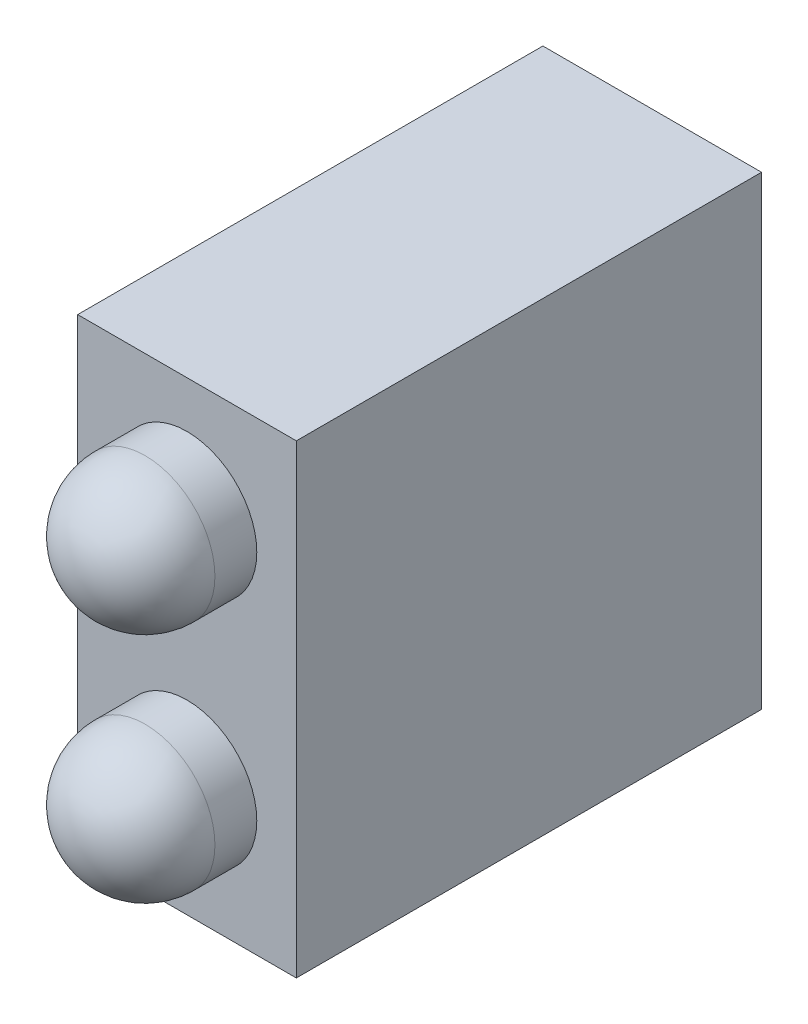
ISO-10303-21;
HEADER;
FILE_DESCRIPTION(('STEP AP214'),'2;1');
FILE_NAME('part.step','',(''),(''),'','','');
FILE_SCHEMA(('AUTOMOTIVE_DESIGN { 1 0 10303 214 1 1 1 1 }'));
ENDSEC;
DATA;
#1=APPLICATION_CONTEXT('core data for automotive mechanical design processes');
#2=APPLICATION_PROTOCOL_DEFINITION('international standard','automotive_design',2000,#1);
#3=PRODUCT_CONTEXT('',#1,'mechanical');
#4=PRODUCT('Part','Part','',(#3));
#5=PRODUCT_RELATED_PRODUCT_CATEGORY('part','',(#4));
#6=PRODUCT_DEFINITION_FORMATION('','',#4);
#7=PRODUCT_DEFINITION_CONTEXT('part definition',#1,'design');
#8=PRODUCT_DEFINITION('design','',#6,#7);
#9=PRODUCT_DEFINITION_SHAPE('','',#8);
#10=(LENGTH_UNIT() NAMED_UNIT(*) SI_UNIT(.MILLI.,.METRE.));
#11=(NAMED_UNIT(*) PLANE_ANGLE_UNIT() SI_UNIT($,.RADIAN.));
#12=(NAMED_UNIT(*) SI_UNIT($,.STERADIAN.) SOLID_ANGLE_UNIT());
#13=UNCERTAINTY_MEASURE_WITH_UNIT(LENGTH_MEASURE(1.E-05),#10,'distance_accuracy_value','');
#14=(GEOMETRIC_REPRESENTATION_CONTEXT(3) GLOBAL_UNCERTAINTY_ASSIGNED_CONTEXT((#13)) GLOBAL_UNIT_ASSIGNED_CONTEXT((#10,
#11,#12)) REPRESENTATION_CONTEXT('',''));
#15=CARTESIAN_POINT('',(0.,0.,0.));
#16=DIRECTION('',(0.,0.,1.));
#17=DIRECTION('',(1.,0.,0.));
#18=AXIS2_PLACEMENT_3D('',#15,#16,#17);
#19=CARTESIAN_POINT('',(2.35,2.5,12.4));
#20=DIRECTION('',(0.,0.,-1.));
#21=DIRECTION('',(-1.,0.,0.));
#22=AXIS2_PLACEMENT_3D('',#19,#20,#21);
#23=CYLINDRICAL_SURFACE('',#22,1.5);
#24=CARTESIAN_POINT('',(2.35,2.5,10.9));
#25=DIRECTION('',(0.,0.,-1.));
#26=DIRECTION('',(-1.,0.,0.));
#27=AXIS2_PLACEMENT_3D('',#24,#25,#26);
#28=CIRCLE('',#27,1.5);
#29=CARTESIAN_POINT('',(0.849999999999998,2.5,10.9));
#30=VERTEX_POINT('',#29);
#31=EDGE_CURVE('E11',#30,#30,#28,.T.);
#32=ORIENTED_EDGE('',*,*,#31,.T.);
#33=EDGE_LOOP('',(#32));
#34=FACE_BOUND('',#33,.T.);
#35=CARTESIAN_POINT('',(2.35,2.5,10.));
#36=DIRECTION('',(0.,0.,1.));
#37=DIRECTION('',(1.,0.,0.));
#38=AXIS2_PLACEMENT_3D('',#35,#36,#37);
#39=CIRCLE('',#38,1.5);
#40=CARTESIAN_POINT('',(3.85,2.5,10.));
#41=VERTEX_POINT('',#40);
#42=EDGE_CURVE('E50',#41,#41,#39,.T.);
#43=ORIENTED_EDGE('',*,*,#42,.T.);
#44=EDGE_LOOP('',(#43));
#45=FACE_BOUND('',#44,.T.);
#46=ADVANCED_FACE('F43',(#34,#45),#23,.T.);
#47=CARTESIAN_POINT('',(2.35,2.5,10.));
#48=DIRECTION('',(0.,0.,1.));
#49=DIRECTION('',(1.,0.,0.));
#50=AXIS2_PLACEMENT_3D('',#47,#48,#49);
#51=PLANE('',#50);
#52=ORIENTED_EDGE('',*,*,#42,.F.);
#53=EDGE_LOOP('',(#52));
#54=FACE_BOUND('',#53,.T.);
#55=ADVANCED_FACE('F57',(#54),#51,.F.);
#56=CARTESIAN_POINT('',(2.35,2.5,10.9));
#57=DIRECTION('',(0.,0.,1.));
#58=DIRECTION('',(1.,0.,0.));
#59=AXIS2_PLACEMENT_3D('',#56,#57,#58);
#60=SPHERICAL_SURFACE('',#59,1.5);
#61=ORIENTED_EDGE('',*,*,#31,.F.);
#62=EDGE_LOOP('',(#61));
#63=FACE_BOUND('',#62,.T.);
#64=ADVANCED_FACE('F45',(#63),#60,.T.);
#65=CLOSED_SHELL('',(#46,#55,#64));
#66=MANIFOLD_SOLID_BREP('B2',#65);
#67=CARTESIAN_POINT('',(2.35,7.5,12.4));
#68=DIRECTION('',(0.,0.,-1.));
#69=DIRECTION('',(-1.,0.,0.));
#70=AXIS2_PLACEMENT_3D('',#67,#68,#69);
#71=CYLINDRICAL_SURFACE('',#70,1.5);
#72=CARTESIAN_POINT('',(2.35,7.5,10.9));
#73=DIRECTION('',(0.,0.,-1.));
#74=DIRECTION('',(-1.,0.,0.));
#75=AXIS2_PLACEMENT_3D('',#72,#73,#74);
#76=CIRCLE('',#75,1.5);
#77=CARTESIAN_POINT('',(0.849999999999998,7.5,10.9));
#78=VERTEX_POINT('',#77);
#79=EDGE_CURVE('E42',#78,#78,#76,.T.);
#80=ORIENTED_EDGE('',*,*,#79,.T.);
#81=EDGE_LOOP('',(#80));
#82=FACE_BOUND('',#81,.T.);
#83=CARTESIAN_POINT('',(2.35,7.5,10.));
#84=DIRECTION('',(0.,0.,1.));
#85=DIRECTION('',(1.,0.,0.));
#86=AXIS2_PLACEMENT_3D('',#83,#84,#85);
#87=CIRCLE('',#86,1.5);
#88=CARTESIAN_POINT('',(3.85,7.5,10.));
#89=VERTEX_POINT('',#88);
#90=EDGE_CURVE('E99',#89,#89,#87,.T.);
#91=ORIENTED_EDGE('',*,*,#90,.T.);
#92=EDGE_LOOP('',(#91));
#93=FACE_BOUND('',#92,.T.);
#94=ADVANCED_FACE('F92',(#82,#93),#71,.T.);
#95=CARTESIAN_POINT('',(2.35,7.5,10.));
#96=DIRECTION('',(0.,0.,1.));
#97=DIRECTION('',(1.,0.,0.));
#98=AXIS2_PLACEMENT_3D('',#95,#96,#97);
#99=PLANE('',#98);
#100=ORIENTED_EDGE('',*,*,#90,.F.);
#101=EDGE_LOOP('',(#100));
#102=FACE_BOUND('',#101,.T.);
#103=ADVANCED_FACE('F106',(#102),#99,.F.);
#104=CARTESIAN_POINT('',(2.35,7.5,10.9));
#105=DIRECTION('',(0.,0.,1.));
#106=DIRECTION('',(1.,0.,0.));
#107=AXIS2_PLACEMENT_3D('',#104,#105,#106);
#108=SPHERICAL_SURFACE('',#107,1.5);
#109=ORIENTED_EDGE('',*,*,#79,.F.);
#110=EDGE_LOOP('',(#109));
#111=FACE_BOUND('',#110,.T.);
#112=ADVANCED_FACE('F94',(#111),#108,.T.);
#113=CLOSED_SHELL('',(#94,#103,#112));
#114=MANIFOLD_SOLID_BREP('B6',#113);
#115=CARTESIAN_POINT('',(0.,0.,10.));
#116=DIRECTION('',(1.,0.,0.));
#117=DIRECTION('',(0.,1.,0.));
#118=AXIS2_PLACEMENT_3D('',#115,#116,#117);
#119=PLANE('',#118);
#120=DIRECTION('',(0.,-1.,0.));
#121=VECTOR('',#120,1.);
#122=CARTESIAN_POINT('',(0.,0.,0.));
#123=LINE('',#122,#121);
#124=CARTESIAN_POINT('',(0.,10.,0.));
#125=VERTEX_POINT('',#124);
#126=CARTESIAN_POINT('',(0.,0.,0.));
#127=VERTEX_POINT('',#126);
#128=EDGE_CURVE('E195',#125,#127,#123,.T.);
#129=ORIENTED_EDGE('',*,*,#128,.T.);
#130=DIRECTION('',(0.,0.,-1.));
#131=VECTOR('',#130,1.);
#132=CARTESIAN_POINT('',(0.,0.,10.));
#133=LINE('',#132,#131);
#134=CARTESIAN_POINT('',(0.,0.,10.));
#135=VERTEX_POINT('',#134);
#136=EDGE_CURVE('E90',#135,#127,#133,.T.);
#137=ORIENTED_EDGE('',*,*,#136,.F.);
#138=DIRECTION('',(0.,-1.,0.));
#139=VECTOR('',#138,1.);
#140=CARTESIAN_POINT('',(0.,0.,10.));
#141=LINE('',#140,#139);
#142=CARTESIAN_POINT('',(0.,10.,10.));
#143=VERTEX_POINT('',#142);
#144=EDGE_CURVE('E183',#143,#135,#141,.T.);
#145=ORIENTED_EDGE('',*,*,#144,.F.);
#146=DIRECTION('',(0.,0.,-1.));
#147=VECTOR('',#146,1.);
#148=CARTESIAN_POINT('',(0.,10.,10.));
#149=LINE('',#148,#147);
#150=EDGE_CURVE('E191',#143,#125,#149,.T.);
#151=ORIENTED_EDGE('',*,*,#150,.T.);
#152=EDGE_LOOP('',(#129,#137,#145,#151));
#153=FACE_BOUND('',#152,.T.);
#154=ADVANCED_FACE('F132',(#153),#119,.F.);
#155=CARTESIAN_POINT('',(0.,0.,10.));
#156=DIRECTION('',(0.,1.,0.));
#157=DIRECTION('',(0.,0.,1.));
#158=AXIS2_PLACEMENT_3D('',#155,#156,#157);
#159=PLANE('',#158);
#160=DIRECTION('',(1.,0.,0.));
#161=VECTOR('',#160,1.);
#162=CARTESIAN_POINT('',(0.,0.,0.));
#163=LINE('',#162,#161);
#164=CARTESIAN_POINT('',(4.7,0.,0.));
#165=VERTEX_POINT('',#164);
#166=EDGE_CURVE('E187',#127,#165,#163,.T.);
#167=ORIENTED_EDGE('',*,*,#166,.T.);
#168=DIRECTION('',(0.,0.,-1.));
#169=VECTOR('',#168,1.);
#170=CARTESIAN_POINT('',(4.7,0.,10.));
#171=LINE('',#170,#169);
#172=CARTESIAN_POINT('',(4.7,0.,10.));
#173=VERTEX_POINT('',#172);
#174=EDGE_CURVE('E140',#173,#165,#171,.T.);
#175=ORIENTED_EDGE('',*,*,#174,.F.);
#176=DIRECTION('',(1.,0.,0.));
#177=VECTOR('',#176,1.);
#178=CARTESIAN_POINT('',(0.,0.,10.));
#179=LINE('',#178,#177);
#180=EDGE_CURVE('E178',#135,#173,#179,.T.);
#181=ORIENTED_EDGE('',*,*,#180,.F.);
#182=ORIENTED_EDGE('',*,*,#136,.T.);
#183=EDGE_LOOP('',(#167,#175,#181,#182));
#184=FACE_BOUND('',#183,.T.);
#185=ADVANCED_FACE('F186',(#184),#159,.F.);
#186=CARTESIAN_POINT('',(4.7,0.,10.));
#187=DIRECTION('',(-1.,0.,0.));
#188=DIRECTION('',(0.,-1.,0.));
#189=AXIS2_PLACEMENT_3D('',#186,#187,#188);
#190=PLANE('',#189);
#191=DIRECTION('',(0.,1.,0.));
#192=VECTOR('',#191,1.);
#193=CARTESIAN_POINT('',(4.7,0.,0.));
#194=LINE('',#193,#192);
#195=CARTESIAN_POINT('',(4.7,10.,0.));
#196=VERTEX_POINT('',#195);
#197=EDGE_CURVE('E165',#165,#196,#194,.T.);
#198=ORIENTED_EDGE('',*,*,#197,.T.);
#199=DIRECTION('',(0.,0.,-1.));
#200=VECTOR('',#199,1.);
#201=CARTESIAN_POINT('',(4.7,10.,10.));
#202=LINE('',#201,#200);
#203=CARTESIAN_POINT('',(4.7,10.,10.));
#204=VERTEX_POINT('',#203);
#205=EDGE_CURVE('E188',#204,#196,#202,.T.);
#206=ORIENTED_EDGE('',*,*,#205,.F.);
#207=DIRECTION('',(0.,1.,0.));
#208=VECTOR('',#207,1.);
#209=CARTESIAN_POINT('',(4.7,0.,10.));
#210=LINE('',#209,#208);
#211=EDGE_CURVE('E181',#173,#204,#210,.T.);
#212=ORIENTED_EDGE('',*,*,#211,.F.);
#213=ORIENTED_EDGE('',*,*,#174,.T.);
#214=EDGE_LOOP('',(#198,#206,#212,#213));
#215=FACE_BOUND('',#214,.T.);
#216=ADVANCED_FACE('F189',(#215),#190,.F.);
#217=CARTESIAN_POINT('',(0.,10.,10.));
#218=DIRECTION('',(0.,-1.,0.));
#219=DIRECTION('',(0.,0.,-1.));
#220=AXIS2_PLACEMENT_3D('',#217,#218,#219);
#221=PLANE('',#220);
#222=DIRECTION('',(-1.,0.,0.));
#223=VECTOR('',#222,1.);
#224=CARTESIAN_POINT('',(0.,10.,0.));
#225=LINE('',#224,#223);
#226=EDGE_CURVE('E171',#196,#125,#225,.T.);
#227=ORIENTED_EDGE('',*,*,#226,.T.);
#228=ORIENTED_EDGE('',*,*,#150,.F.);
#229=DIRECTION('',(-1.,0.,0.));
#230=VECTOR('',#229,1.);
#231=CARTESIAN_POINT('',(0.,10.,10.));
#232=LINE('',#231,#230);
#233=EDGE_CURVE('E148',#204,#143,#232,.T.);
#234=ORIENTED_EDGE('',*,*,#233,.F.);
#235=ORIENTED_EDGE('',*,*,#205,.T.);
#236=EDGE_LOOP('',(#227,#228,#234,#235));
#237=FACE_BOUND('',#236,.T.);
#238=ADVANCED_FACE('F202',(#237),#221,.F.);
#239=CARTESIAN_POINT('',(0.,10.,10.));
#240=DIRECTION('',(0.,0.,-1.));
#241=DIRECTION('',(-1.,0.,0.));
#242=AXIS2_PLACEMENT_3D('',#239,#240,#241);
#243=PLANE('',#242);
#244=ORIENTED_EDGE('',*,*,#144,.T.);
#245=ORIENTED_EDGE('',*,*,#180,.T.);
#246=ORIENTED_EDGE('',*,*,#211,.T.);
#247=ORIENTED_EDGE('',*,*,#233,.T.);
#248=EDGE_LOOP('',(#244,#245,#246,#247));
#249=FACE_BOUND('',#248,.T.);
#250=ADVANCED_FACE('F179',(#249),#243,.F.);
#251=CARTESIAN_POINT('',(0.,10.,0.));
#252=DIRECTION('',(0.,0.,-1.));
#253=DIRECTION('',(-1.,0.,0.));
#254=AXIS2_PLACEMENT_3D('',#251,#252,#253);
#255=PLANE('',#254);
#256=ORIENTED_EDGE('',*,*,#128,.F.);
#257=ORIENTED_EDGE('',*,*,#226,.F.);
#258=ORIENTED_EDGE('',*,*,#197,.F.);
#259=ORIENTED_EDGE('',*,*,#166,.F.);
#260=EDGE_LOOP('',(#256,#257,#258,#259));
#261=FACE_BOUND('',#260,.T.);
#262=ADVANCED_FACE('F205',(#261),#255,.T.);
#263=CLOSED_SHELL('',(#154,#185,#216,#238,#250,#262));
#264=MANIFOLD_SOLID_BREP('B37',#263);
#265=ADVANCED_BREP_SHAPE_REPRESENTATION('',(#18,#66,#114,#264),#14);
#266=SHAPE_DEFINITION_REPRESENTATION(#9,#265);
ENDSEC;
END-ISO-10303-21;
